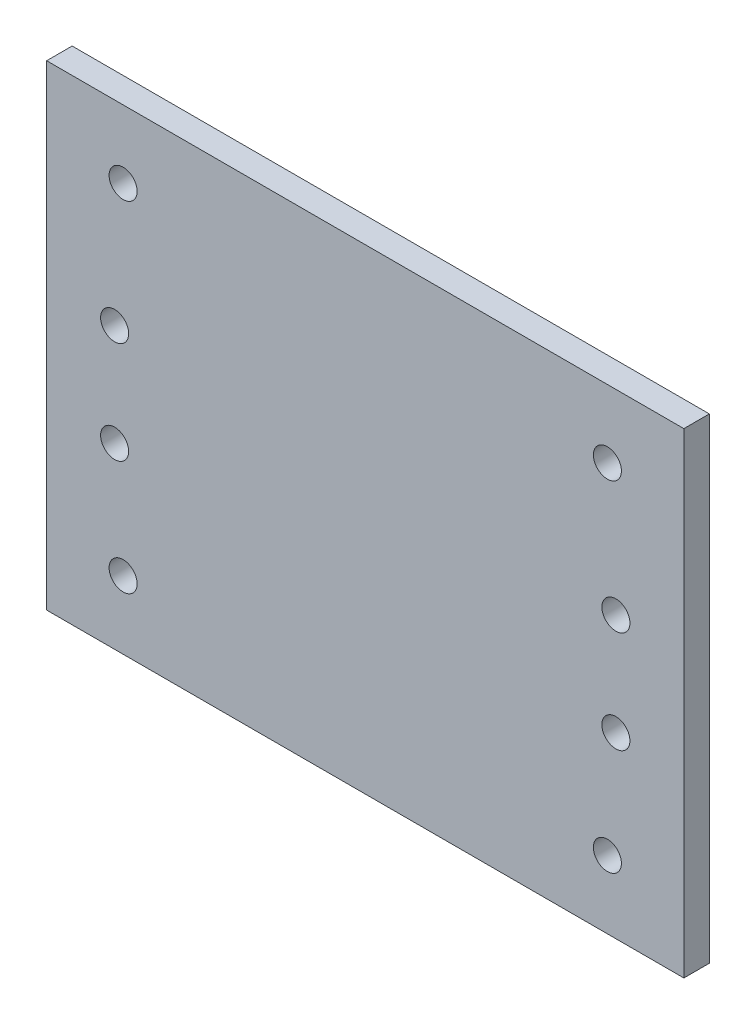
ISO-10303-21;
HEADER;
FILE_DESCRIPTION(('STEP AP214'),'2;1');
FILE_NAME('part.step','',(''),(''),'','','');
FILE_SCHEMA(('AUTOMOTIVE_DESIGN { 1 0 10303 214 1 1 1 1 }'));
ENDSEC;
DATA;
#1=APPLICATION_CONTEXT('core data for automotive mechanical design processes');
#2=APPLICATION_PROTOCOL_DEFINITION('international standard','automotive_design',2000,#1);
#3=PRODUCT_CONTEXT('',#1,'mechanical');
#4=PRODUCT('Part','Part','',(#3));
#5=PRODUCT_RELATED_PRODUCT_CATEGORY('part','',(#4));
#6=PRODUCT_DEFINITION_FORMATION('','',#4);
#7=PRODUCT_DEFINITION_CONTEXT('part definition',#1,'design');
#8=PRODUCT_DEFINITION('design','',#6,#7);
#9=PRODUCT_DEFINITION_SHAPE('','',#8);
#10=(LENGTH_UNIT() NAMED_UNIT(*) SI_UNIT(.MILLI.,.METRE.));
#11=(NAMED_UNIT(*) PLANE_ANGLE_UNIT() SI_UNIT($,.RADIAN.));
#12=(NAMED_UNIT(*) SI_UNIT($,.STERADIAN.) SOLID_ANGLE_UNIT());
#13=UNCERTAINTY_MEASURE_WITH_UNIT(LENGTH_MEASURE(1.E-05),#10,'distance_accuracy_value','');
#14=(GEOMETRIC_REPRESENTATION_CONTEXT(3) GLOBAL_UNCERTAINTY_ASSIGNED_CONTEXT((#13)) GLOBAL_UNIT_ASSIGNED_CONTEXT((#10,
#11,#12)) REPRESENTATION_CONTEXT('',''));
#15=CARTESIAN_POINT('',(0.,0.,0.));
#16=DIRECTION('',(0.,0.,1.));
#17=DIRECTION('',(1.,0.,0.));
#18=AXIS2_PLACEMENT_3D('',#15,#16,#17);
#19=CARTESIAN_POINT('',(37.5,28.,3.));
#20=DIRECTION('',(-1.,0.,0.));
#21=DIRECTION('',(0.,-1.,0.));
#22=AXIS2_PLACEMENT_3D('',#19,#20,#21);
#23=PLANE('',#22);
#24=DIRECTION('',(0.,1.,0.));
#25=VECTOR('',#24,1.);
#26=CARTESIAN_POINT('',(37.5,28.,0.));
#27=LINE('',#26,#25);
#28=CARTESIAN_POINT('',(37.5,-28.,0.));
#29=VERTEX_POINT('',#28);
#30=CARTESIAN_POINT('',(37.5,28.,0.));
#31=VERTEX_POINT('',#30);
#32=EDGE_CURVE('E99',#29,#31,#27,.T.);
#33=ORIENTED_EDGE('',*,*,#32,.T.);
#34=DIRECTION('',(0.,0.,-1.));
#35=VECTOR('',#34,1.);
#36=CARTESIAN_POINT('',(37.5,28.,3.));
#37=LINE('',#36,#35);
#38=CARTESIAN_POINT('',(37.5,28.,3.));
#39=VERTEX_POINT('',#38);
#40=EDGE_CURVE('E11',#39,#31,#37,.T.);
#41=ORIENTED_EDGE('',*,*,#40,.F.);
#42=DIRECTION('',(0.,1.,0.));
#43=VECTOR('',#42,1.);
#44=CARTESIAN_POINT('',(37.5,28.,3.));
#45=LINE('',#44,#43);
#46=CARTESIAN_POINT('',(37.5,-28.,3.));
#47=VERTEX_POINT('',#46);
#48=EDGE_CURVE('E87',#47,#39,#45,.T.);
#49=ORIENTED_EDGE('',*,*,#48,.F.);
#50=DIRECTION('',(0.,0.,-1.));
#51=VECTOR('',#50,1.);
#52=CARTESIAN_POINT('',(37.5,-28.,3.));
#53=LINE('',#52,#51);
#54=EDGE_CURVE('E95',#47,#29,#53,.T.);
#55=ORIENTED_EDGE('',*,*,#54,.T.);
#56=EDGE_LOOP('',(#33,#41,#49,#55));
#57=FACE_BOUND('',#56,.T.);
#58=ADVANCED_FACE('F36',(#57),#23,.F.);
#59=CARTESIAN_POINT('',(-37.5,28.,3.));
#60=DIRECTION('',(0.,-1.,0.));
#61=DIRECTION('',(0.,0.,-1.));
#62=AXIS2_PLACEMENT_3D('',#59,#60,#61);
#63=PLANE('',#62);
#64=DIRECTION('',(-1.,0.,0.));
#65=VECTOR('',#64,1.);
#66=CARTESIAN_POINT('',(-37.5,28.,0.));
#67=LINE('',#66,#65);
#68=CARTESIAN_POINT('',(-37.5,28.,0.));
#69=VERTEX_POINT('',#68);
#70=EDGE_CURVE('E91',#31,#69,#67,.T.);
#71=ORIENTED_EDGE('',*,*,#70,.T.);
#72=DIRECTION('',(0.,0.,-1.));
#73=VECTOR('',#72,1.);
#74=CARTESIAN_POINT('',(-37.5,28.,3.));
#75=LINE('',#74,#73);
#76=CARTESIAN_POINT('',(-37.5,28.,3.));
#77=VERTEX_POINT('',#76);
#78=EDGE_CURVE('E44',#77,#69,#75,.T.);
#79=ORIENTED_EDGE('',*,*,#78,.F.);
#80=DIRECTION('',(-1.,0.,0.));
#81=VECTOR('',#80,1.);
#82=CARTESIAN_POINT('',(-37.5,28.,3.));
#83=LINE('',#82,#81);
#84=EDGE_CURVE('E82',#39,#77,#83,.T.);
#85=ORIENTED_EDGE('',*,*,#84,.F.);
#86=ORIENTED_EDGE('',*,*,#40,.T.);
#87=EDGE_LOOP('',(#71,#79,#85,#86));
#88=FACE_BOUND('',#87,.T.);
#89=ADVANCED_FACE('F90',(#88),#63,.F.);
#90=CARTESIAN_POINT('',(-37.5,28.,3.));
#91=DIRECTION('',(1.,0.,0.));
#92=DIRECTION('',(0.,1.,0.));
#93=AXIS2_PLACEMENT_3D('',#90,#91,#92);
#94=PLANE('',#93);
#95=DIRECTION('',(0.,-1.,0.));
#96=VECTOR('',#95,1.);
#97=CARTESIAN_POINT('',(-37.5,28.,0.));
#98=LINE('',#97,#96);
#99=CARTESIAN_POINT('',(-37.5,-28.,0.));
#100=VERTEX_POINT('',#99);
#101=EDGE_CURVE('E69',#69,#100,#98,.T.);
#102=ORIENTED_EDGE('',*,*,#101,.T.);
#103=DIRECTION('',(0.,0.,-1.));
#104=VECTOR('',#103,1.);
#105=CARTESIAN_POINT('',(-37.5,-28.,3.));
#106=LINE('',#105,#104);
#107=CARTESIAN_POINT('',(-37.5,-28.,3.));
#108=VERTEX_POINT('',#107);
#109=EDGE_CURVE('E92',#108,#100,#106,.T.);
#110=ORIENTED_EDGE('',*,*,#109,.F.);
#111=DIRECTION('',(0.,-1.,0.));
#112=VECTOR('',#111,1.);
#113=CARTESIAN_POINT('',(-37.5,28.,3.));
#114=LINE('',#113,#112);
#115=EDGE_CURVE('E85',#77,#108,#114,.T.);
#116=ORIENTED_EDGE('',*,*,#115,.F.);
#117=ORIENTED_EDGE('',*,*,#78,.T.);
#118=EDGE_LOOP('',(#102,#110,#116,#117));
#119=FACE_BOUND('',#118,.T.);
#120=ADVANCED_FACE('F93',(#119),#94,.F.);
#121=CARTESIAN_POINT('',(-37.5,-28.,3.));
#122=DIRECTION('',(0.,1.,0.));
#123=DIRECTION('',(0.,0.,1.));
#124=AXIS2_PLACEMENT_3D('',#121,#122,#123);
#125=PLANE('',#124);
#126=DIRECTION('',(1.,0.,0.));
#127=VECTOR('',#126,1.);
#128=CARTESIAN_POINT('',(-37.5,-28.,0.));
#129=LINE('',#128,#127);
#130=EDGE_CURVE('E75',#100,#29,#129,.T.);
#131=ORIENTED_EDGE('',*,*,#130,.T.);
#132=ORIENTED_EDGE('',*,*,#54,.F.);
#133=DIRECTION('',(1.,0.,0.));
#134=VECTOR('',#133,1.);
#135=CARTESIAN_POINT('',(-37.5,-28.,3.));
#136=LINE('',#135,#134);
#137=EDGE_CURVE('E52',#108,#47,#136,.T.);
#138=ORIENTED_EDGE('',*,*,#137,.F.);
#139=ORIENTED_EDGE('',*,*,#109,.T.);
#140=EDGE_LOOP('',(#131,#132,#138,#139));
#141=FACE_BOUND('',#140,.T.);
#142=ADVANCED_FACE('F107',(#141),#125,.F.);
#143=CARTESIAN_POINT('',(0.,0.,3.));
#144=DIRECTION('',(0.,0.,1.));
#145=DIRECTION('',(1.,0.,0.));
#146=AXIS2_PLACEMENT_3D('',#143,#144,#145);
#147=PLANE('',#146);
#148=CARTESIAN_POINT('',(-29.5,-7.,3.));
#149=DIRECTION('',(0.,0.,1.));
#150=DIRECTION('',(1.,0.,0.));
#151=AXIS2_PLACEMENT_3D('',#148,#149,#150);
#152=CIRCLE('',#151,1.65);
#153=CARTESIAN_POINT('',(-27.85,-7.,3.));
#154=VERTEX_POINT('',#153);
#155=EDGE_CURVE('E134',#154,#154,#152,.T.);
#156=ORIENTED_EDGE('',*,*,#155,.F.);
#157=EDGE_LOOP('',(#156));
#158=FACE_BOUND('',#157,.T.);
#159=CARTESIAN_POINT('',(29.5,-7.,3.));
#160=DIRECTION('',(0.,0.,1.));
#161=DIRECTION('',(1.,0.,0.));
#162=AXIS2_PLACEMENT_3D('',#159,#160,#161);
#163=CIRCLE('',#162,1.65);
#164=CARTESIAN_POINT('',(31.15,-7.,3.));
#165=VERTEX_POINT('',#164);
#166=EDGE_CURVE('E139',#165,#165,#163,.T.);
#167=ORIENTED_EDGE('',*,*,#166,.F.);
#168=EDGE_LOOP('',(#167));
#169=FACE_BOUND('',#168,.T.);
#170=CARTESIAN_POINT('',(29.5,5.,3.));
#171=DIRECTION('',(0.,0.,1.));
#172=DIRECTION('',(1.,0.,0.));
#173=AXIS2_PLACEMENT_3D('',#170,#171,#172);
#174=CIRCLE('',#173,1.65);
#175=CARTESIAN_POINT('',(31.15,5.,3.));
#176=VERTEX_POINT('',#175);
#177=EDGE_CURVE('E142',#176,#176,#174,.T.);
#178=ORIENTED_EDGE('',*,*,#177,.F.);
#179=EDGE_LOOP('',(#178));
#180=FACE_BOUND('',#179,.T.);
#181=CARTESIAN_POINT('',(-29.5,5.,3.));
#182=DIRECTION('',(0.,0.,1.));
#183=DIRECTION('',(1.,0.,0.));
#184=AXIS2_PLACEMENT_3D('',#181,#182,#183);
#185=CIRCLE('',#184,1.65);
#186=CARTESIAN_POINT('',(-27.85,5.,3.));
#187=VERTEX_POINT('',#186);
#188=EDGE_CURVE('E145',#187,#187,#185,.T.);
#189=ORIENTED_EDGE('',*,*,#188,.F.);
#190=EDGE_LOOP('',(#189));
#191=FACE_BOUND('',#190,.T.);
#192=CARTESIAN_POINT('',(-28.5,20.,3.));
#193=DIRECTION('',(0.,0.,-1.));
#194=DIRECTION('',(-1.,0.,0.));
#195=AXIS2_PLACEMENT_3D('',#192,#193,#194);
#196=CIRCLE('',#195,1.65);
#197=CARTESIAN_POINT('',(-30.15,20.,3.));
#198=VERTEX_POINT('',#197);
#199=EDGE_CURVE('E116',#198,#198,#196,.T.);
#200=ORIENTED_EDGE('',*,*,#199,.T.);
#201=EDGE_LOOP('',(#200));
#202=FACE_BOUND('',#201,.T.);
#203=CARTESIAN_POINT('',(28.5,-20.,3.));
#204=DIRECTION('',(0.,0.,-1.));
#205=DIRECTION('',(-1.,0.,0.));
#206=AXIS2_PLACEMENT_3D('',#203,#204,#205);
#207=CIRCLE('',#206,1.65);
#208=CARTESIAN_POINT('',(26.85,-20.,3.));
#209=VERTEX_POINT('',#208);
#210=EDGE_CURVE('E122',#209,#209,#207,.T.);
#211=ORIENTED_EDGE('',*,*,#210,.T.);
#212=EDGE_LOOP('',(#211));
#213=FACE_BOUND('',#212,.T.);
#214=CARTESIAN_POINT('',(-28.5,-20.,3.));
#215=DIRECTION('',(0.,0.,-1.));
#216=DIRECTION('',(-1.,0.,0.));
#217=AXIS2_PLACEMENT_3D('',#214,#215,#216);
#218=CIRCLE('',#217,1.65);
#219=CARTESIAN_POINT('',(-30.15,-20.,3.));
#220=VERTEX_POINT('',#219);
#221=EDGE_CURVE('E123',#220,#220,#218,.T.);
#222=ORIENTED_EDGE('',*,*,#221,.T.);
#223=EDGE_LOOP('',(#222));
#224=FACE_BOUND('',#223,.T.);
#225=CARTESIAN_POINT('',(28.5,20.,3.));
#226=DIRECTION('',(0.,0.,-1.));
#227=DIRECTION('',(-1.,0.,0.));
#228=AXIS2_PLACEMENT_3D('',#225,#226,#227);
#229=CIRCLE('',#228,1.65);
#230=CARTESIAN_POINT('',(26.85,20.,3.));
#231=VERTEX_POINT('',#230);
#232=EDGE_CURVE('E102',#231,#231,#229,.T.);
#233=ORIENTED_EDGE('',*,*,#232,.T.);
#234=EDGE_LOOP('',(#233));
#235=FACE_BOUND('',#234,.T.);
#236=ORIENTED_EDGE('',*,*,#48,.T.);
#237=ORIENTED_EDGE('',*,*,#84,.T.);
#238=ORIENTED_EDGE('',*,*,#115,.T.);
#239=ORIENTED_EDGE('',*,*,#137,.T.);
#240=EDGE_LOOP('',(#236,#237,#238,#239));
#241=FACE_BOUND('',#240,.T.);
#242=ADVANCED_FACE('F83',(#158,#169,#180,#191,#202,#213,#224,#235,#241),#147,.T.);
#243=CARTESIAN_POINT('',(0.,0.,0.));
#244=DIRECTION('',(0.,0.,1.));
#245=DIRECTION('',(1.,0.,0.));
#246=AXIS2_PLACEMENT_3D('',#243,#244,#245);
#247=PLANE('',#246);
#248=CARTESIAN_POINT('',(-29.5,-7.,0.));
#249=DIRECTION('',(0.,0.,-1.));
#250=DIRECTION('',(-1.,0.,0.));
#251=AXIS2_PLACEMENT_3D('',#248,#249,#250);
#252=CIRCLE('',#251,1.65);
#253=CARTESIAN_POINT('',(-31.15,-7.,0.));
#254=VERTEX_POINT('',#253);
#255=EDGE_CURVE('E152',#254,#254,#252,.T.);
#256=ORIENTED_EDGE('',*,*,#255,.F.);
#257=EDGE_LOOP('',(#256));
#258=FACE_BOUND('',#257,.T.);
#259=CARTESIAN_POINT('',(29.5,-7.,0.));
#260=DIRECTION('',(0.,0.,-1.));
#261=DIRECTION('',(-1.,0.,0.));
#262=AXIS2_PLACEMENT_3D('',#259,#260,#261);
#263=CIRCLE('',#262,1.65);
#264=CARTESIAN_POINT('',(27.85,-7.,0.));
#265=VERTEX_POINT('',#264);
#266=EDGE_CURVE('E155',#265,#265,#263,.T.);
#267=ORIENTED_EDGE('',*,*,#266,.F.);
#268=EDGE_LOOP('',(#267));
#269=FACE_BOUND('',#268,.T.);
#270=CARTESIAN_POINT('',(29.5,5.,0.));
#271=DIRECTION('',(0.,0.,-1.));
#272=DIRECTION('',(-1.,0.,0.));
#273=AXIS2_PLACEMENT_3D('',#270,#271,#272);
#274=CIRCLE('',#273,1.65);
#275=CARTESIAN_POINT('',(27.85,5.,0.));
#276=VERTEX_POINT('',#275);
#277=EDGE_CURVE('E151',#276,#276,#274,.T.);
#278=ORIENTED_EDGE('',*,*,#277,.F.);
#279=EDGE_LOOP('',(#278));
#280=FACE_BOUND('',#279,.T.);
#281=CARTESIAN_POINT('',(-29.5,5.,0.));
#282=DIRECTION('',(0.,0.,-1.));
#283=DIRECTION('',(-1.,0.,0.));
#284=AXIS2_PLACEMENT_3D('',#281,#282,#283);
#285=CIRCLE('',#284,1.65);
#286=CARTESIAN_POINT('',(-31.15,5.,0.));
#287=VERTEX_POINT('',#286);
#288=EDGE_CURVE('E148',#287,#287,#285,.T.);
#289=ORIENTED_EDGE('',*,*,#288,.F.);
#290=EDGE_LOOP('',(#289));
#291=FACE_BOUND('',#290,.T.);
#292=CARTESIAN_POINT('',(-28.5,20.,0.));
#293=DIRECTION('',(0.,0.,-1.));
#294=DIRECTION('',(-1.,0.,0.));
#295=AXIS2_PLACEMENT_3D('',#292,#293,#294);
#296=CIRCLE('',#295,1.65);
#297=CARTESIAN_POINT('',(-30.15,20.,0.));
#298=VERTEX_POINT('',#297);
#299=EDGE_CURVE('E126',#298,#298,#296,.T.);
#300=ORIENTED_EDGE('',*,*,#299,.F.);
#301=EDGE_LOOP('',(#300));
#302=FACE_BOUND('',#301,.T.);
#303=CARTESIAN_POINT('',(28.5,-20.,0.));
#304=DIRECTION('',(0.,0.,-1.));
#305=DIRECTION('',(-1.,0.,0.));
#306=AXIS2_PLACEMENT_3D('',#303,#304,#305);
#307=CIRCLE('',#306,1.65);
#308=CARTESIAN_POINT('',(26.85,-20.,0.));
#309=VERTEX_POINT('',#308);
#310=EDGE_CURVE('E119',#309,#309,#307,.T.);
#311=ORIENTED_EDGE('',*,*,#310,.F.);
#312=EDGE_LOOP('',(#311));
#313=FACE_BOUND('',#312,.T.);
#314=CARTESIAN_POINT('',(-28.5,-20.,0.));
#315=DIRECTION('',(0.,0.,-1.));
#316=DIRECTION('',(-1.,0.,0.));
#317=AXIS2_PLACEMENT_3D('',#314,#315,#316);
#318=CIRCLE('',#317,1.65);
#319=CARTESIAN_POINT('',(-30.15,-20.,0.));
#320=VERTEX_POINT('',#319);
#321=EDGE_CURVE('E131',#320,#320,#318,.T.);
#322=ORIENTED_EDGE('',*,*,#321,.F.);
#323=EDGE_LOOP('',(#322));
#324=FACE_BOUND('',#323,.T.);
#325=CARTESIAN_POINT('',(28.5,20.,0.));
#326=DIRECTION('',(0.,0.,-1.));
#327=DIRECTION('',(-1.,0.,0.));
#328=AXIS2_PLACEMENT_3D('',#325,#326,#327);
#329=CIRCLE('',#328,1.65);
#330=CARTESIAN_POINT('',(26.85,20.,0.));
#331=VERTEX_POINT('',#330);
#332=EDGE_CURVE('E113',#331,#331,#329,.T.);
#333=ORIENTED_EDGE('',*,*,#332,.F.);
#334=EDGE_LOOP('',(#333));
#335=FACE_BOUND('',#334,.T.);
#336=ORIENTED_EDGE('',*,*,#32,.F.);
#337=ORIENTED_EDGE('',*,*,#130,.F.);
#338=ORIENTED_EDGE('',*,*,#101,.F.);
#339=ORIENTED_EDGE('',*,*,#70,.F.);
#340=EDGE_LOOP('',(#336,#337,#338,#339));
#341=FACE_BOUND('',#340,.T.);
#342=ADVANCED_FACE('F110',(#258,#269,#280,#291,#302,#313,#324,#335,#341),#247,.F.);
#343=CARTESIAN_POINT('',(28.5,20.,3.));
#344=DIRECTION('',(0.,0.,-1.));
#345=DIRECTION('',(-1.,0.,0.));
#346=AXIS2_PLACEMENT_3D('',#343,#344,#345);
#347=CYLINDRICAL_SURFACE('',#346,1.65);
#348=ORIENTED_EDGE('',*,*,#232,.F.);
#349=EDGE_LOOP('',(#348));
#350=FACE_BOUND('',#349,.T.);
#351=ORIENTED_EDGE('',*,*,#332,.T.);
#352=EDGE_LOOP('',(#351));
#353=FACE_BOUND('',#352,.T.);
#354=ADVANCED_FACE('F165',(#350,#353),#347,.F.);
#355=CARTESIAN_POINT('',(-28.5,-20.,3.));
#356=DIRECTION('',(0.,0.,-1.));
#357=DIRECTION('',(-1.,0.,0.));
#358=AXIS2_PLACEMENT_3D('',#355,#356,#357);
#359=CYLINDRICAL_SURFACE('',#358,1.65);
#360=ORIENTED_EDGE('',*,*,#221,.F.);
#361=EDGE_LOOP('',(#360));
#362=FACE_BOUND('',#361,.T.);
#363=ORIENTED_EDGE('',*,*,#321,.T.);
#364=EDGE_LOOP('',(#363));
#365=FACE_BOUND('',#364,.T.);
#366=ADVANCED_FACE('F179',(#362,#365),#359,.F.);
#367=CARTESIAN_POINT('',(28.5,-20.,3.));
#368=DIRECTION('',(0.,0.,-1.));
#369=DIRECTION('',(-1.,0.,0.));
#370=AXIS2_PLACEMENT_3D('',#367,#368,#369);
#371=CYLINDRICAL_SURFACE('',#370,1.65);
#372=ORIENTED_EDGE('',*,*,#210,.F.);
#373=EDGE_LOOP('',(#372));
#374=FACE_BOUND('',#373,.T.);
#375=ORIENTED_EDGE('',*,*,#310,.T.);
#376=EDGE_LOOP('',(#375));
#377=FACE_BOUND('',#376,.T.);
#378=ADVANCED_FACE('F185',(#374,#377),#371,.F.);
#379=CARTESIAN_POINT('',(-28.5,20.,3.));
#380=DIRECTION('',(0.,0.,-1.));
#381=DIRECTION('',(-1.,0.,0.));
#382=AXIS2_PLACEMENT_3D('',#379,#380,#381);
#383=CYLINDRICAL_SURFACE('',#382,1.65);
#384=ORIENTED_EDGE('',*,*,#199,.F.);
#385=EDGE_LOOP('',(#384));
#386=FACE_BOUND('',#385,.T.);
#387=ORIENTED_EDGE('',*,*,#299,.T.);
#388=EDGE_LOOP('',(#387));
#389=FACE_BOUND('',#388,.T.);
#390=ADVANCED_FACE('F223',(#386,#389),#383,.F.);
#391=CARTESIAN_POINT('',(-29.5,5.,8.));
#392=DIRECTION('',(0.,0.,-1.));
#393=DIRECTION('',(-1.,0.,0.));
#394=AXIS2_PLACEMENT_3D('',#391,#392,#393);
#395=CYLINDRICAL_SURFACE('',#394,1.65);
#396=ORIENTED_EDGE('',*,*,#188,.T.);
#397=EDGE_LOOP('',(#396));
#398=FACE_BOUND('',#397,.T.);
#399=ORIENTED_EDGE('',*,*,#288,.T.);
#400=EDGE_LOOP('',(#399));
#401=FACE_BOUND('',#400,.T.);
#402=ADVANCED_FACE('F227',(#398,#401),#395,.F.);
#403=CARTESIAN_POINT('',(29.5,5.,8.));
#404=DIRECTION('',(0.,0.,-1.));
#405=DIRECTION('',(-1.,0.,0.));
#406=AXIS2_PLACEMENT_3D('',#403,#404,#405);
#407=CYLINDRICAL_SURFACE('',#406,1.65);
#408=ORIENTED_EDGE('',*,*,#177,.T.);
#409=EDGE_LOOP('',(#408));
#410=FACE_BOUND('',#409,.T.);
#411=ORIENTED_EDGE('',*,*,#277,.T.);
#412=EDGE_LOOP('',(#411));
#413=FACE_BOUND('',#412,.T.);
#414=ADVANCED_FACE('F161',(#410,#413),#407,.F.);
#415=CARTESIAN_POINT('',(29.5,-7.,8.));
#416=DIRECTION('',(0.,0.,-1.));
#417=DIRECTION('',(-1.,0.,0.));
#418=AXIS2_PLACEMENT_3D('',#415,#416,#417);
#419=CYLINDRICAL_SURFACE('',#418,1.65);
#420=ORIENTED_EDGE('',*,*,#166,.T.);
#421=EDGE_LOOP('',(#420));
#422=FACE_BOUND('',#421,.T.);
#423=ORIENTED_EDGE('',*,*,#266,.T.);
#424=EDGE_LOOP('',(#423));
#425=FACE_BOUND('',#424,.T.);
#426=ADVANCED_FACE('F237',(#422,#425),#419,.F.);
#427=CARTESIAN_POINT('',(-29.5,-7.,8.));
#428=DIRECTION('',(0.,0.,-1.));
#429=DIRECTION('',(-1.,0.,0.));
#430=AXIS2_PLACEMENT_3D('',#427,#428,#429);
#431=CYLINDRICAL_SURFACE('',#430,1.65);
#432=ORIENTED_EDGE('',*,*,#155,.T.);
#433=EDGE_LOOP('',(#432));
#434=FACE_BOUND('',#433,.T.);
#435=ORIENTED_EDGE('',*,*,#255,.T.);
#436=EDGE_LOOP('',(#435));
#437=FACE_BOUND('',#436,.T.);
#438=ADVANCED_FACE('F234',(#434,#437),#431,.F.);
#439=CLOSED_SHELL('',(#58,#89,#120,#142,#242,#342,#354,#366,#378,#390,#402,#414,#426,#438));
#440=MANIFOLD_SOLID_BREP('B2',#439);
#441=ADVANCED_BREP_SHAPE_REPRESENTATION('',(#18,#440),#14);
#442=SHAPE_DEFINITION_REPRESENTATION(#9,#441);
ENDSEC;
END-ISO-10303-21;
